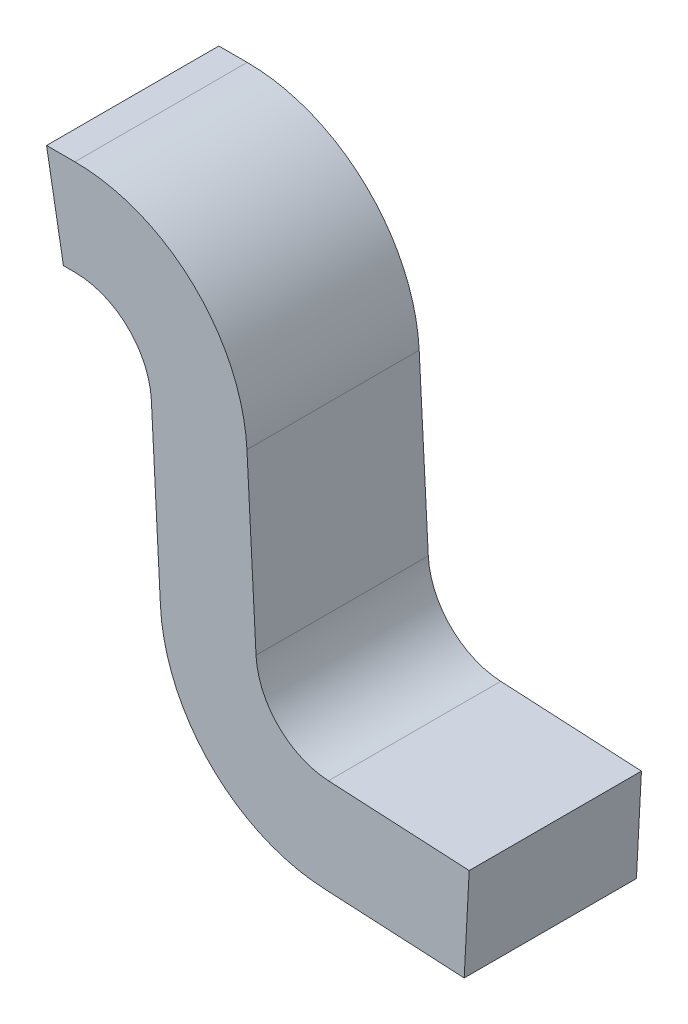
ISO-10303-21;
HEADER;
FILE_DESCRIPTION(('STEP AP214'),'2;1');
FILE_NAME('part.step','',(''),(''),'','','');
FILE_SCHEMA(('AUTOMOTIVE_DESIGN { 1 0 10303 214 1 1 1 1 }'));
ENDSEC;
DATA;
#1=APPLICATION_CONTEXT('core data for automotive mechanical design processes');
#2=APPLICATION_PROTOCOL_DEFINITION('international standard','automotive_design',2000,#1);
#3=PRODUCT_CONTEXT('',#1,'mechanical');
#4=PRODUCT('Part','Part','',(#3));
#5=PRODUCT_RELATED_PRODUCT_CATEGORY('part','',(#4));
#6=PRODUCT_DEFINITION_FORMATION('','',#4);
#7=PRODUCT_DEFINITION_CONTEXT('part definition',#1,'design');
#8=PRODUCT_DEFINITION('design','',#6,#7);
#9=PRODUCT_DEFINITION_SHAPE('','',#8);
#10=(LENGTH_UNIT() NAMED_UNIT(*) SI_UNIT(.MILLI.,.METRE.));
#11=(NAMED_UNIT(*) PLANE_ANGLE_UNIT() SI_UNIT($,.RADIAN.));
#12=(NAMED_UNIT(*) SI_UNIT($,.STERADIAN.) SOLID_ANGLE_UNIT());
#13=UNCERTAINTY_MEASURE_WITH_UNIT(LENGTH_MEASURE(1.E-05),#10,'distance_accuracy_value','');
#14=(GEOMETRIC_REPRESENTATION_CONTEXT(3) GLOBAL_UNCERTAINTY_ASSIGNED_CONTEXT((#13)) GLOBAL_UNIT_ASSIGNED_CONTEXT((#10,
#11,#12)) REPRESENTATION_CONTEXT('',''));
#15=CARTESIAN_POINT('',(0.,0.,0.));
#16=DIRECTION('',(0.,0.,1.));
#17=DIRECTION('',(1.,0.,0.));
#18=AXIS2_PLACEMENT_3D('',#15,#16,#17);
#19=CARTESIAN_POINT('',(0.,0.,-0.1125));
#20=DIRECTION('',(0.,0.,1.));
#21=DIRECTION('',(1.,0.,0.));
#22=AXIS2_PLACEMENT_3D('',#19,#20,#21);
#23=PLANE('',#22);
#24=DIRECTION('',(-0.0523359562429177,0.998629534754575,0.));
#25=VECTOR('',#24,1.);
#26=CARTESIAN_POINT('',(0.861573213012,-0.31493822705,-0.1125));
#27=LINE('',#26,#25);
#28=CARTESIAN_POINT('',(0.861573213012008,-0.31493822705016,-0.1125));
#29=VERTEX_POINT('',#28);
#30=CARTESIAN_POINT('',(0.849691645319655,-0.0882244098453541,-0.1125));
#31=VERTEX_POINT('',#30);
#32=EDGE_CURVE('E144',#29,#31,#27,.T.);
#33=ORIENTED_EDGE('',*,*,#32,.F.);
#34=CARTESIAN_POINT('',(0.961436166488,-0.309704631426,-0.1125));
#35=DIRECTION('',(0.,0.,1.));
#36=DIRECTION('',(1.,0.,0.));
#37=AXIS2_PLACEMENT_3D('',#34,#35,#36);
#38=CIRCLE('',#37,0.1);
#39=CARTESIAN_POINT('',(0.956202570863354,-0.40956758490123,-0.1125));
#40=VERTEX_POINT('',#39);
#41=EDGE_CURVE('E151',#29,#40,#38,.T.);
#42=ORIENTED_EDGE('',*,*,#41,.T.);
#43=DIRECTION('',(-0.998629534754575,0.0523359562429177,0.));
#44=VECTOR('',#43,1.);
#45=CARTESIAN_POINT('',(1.14,-0.4192,-0.1125));
#46=LINE('',#45,#44);
#47=CARTESIAN_POINT('',(1.14000000000012,-0.419200000000006,-0.1125));
#48=VERTEX_POINT('',#47);
#49=EDGE_CURVE('E148',#48,#40,#46,.T.);
#50=ORIENTED_EDGE('',*,*,#49,.F.);
#51=DIRECTION('',(0.0523359562429177,0.998629534754575,0.));
#52=VECTOR('',#51,1.);
#53=CARTESIAN_POINT('',(1.13345800547,-0.544028691844,-0.1125));
#54=LINE('',#53,#52);
#55=CARTESIAN_POINT('',(1.13345800547,-0.544028691843999,-0.1125));
#56=VERTEX_POINT('',#55);
#57=EDGE_CURVE('E155',#56,#48,#54,.T.);
#58=ORIENTED_EDGE('',*,*,#57,.F.);
#59=DIRECTION('',(0.998629534754575,-0.0523359562429177,0.));
#60=VECTOR('',#59,1.);
#61=CARTESIAN_POINT('',(0.949660576333,-0.534396276745,-0.1125));
#62=LINE('',#61,#60);
#63=CARTESIAN_POINT('',(0.949660576333192,-0.53439627674501,-0.1125));
#64=VERTEX_POINT('',#63);
#65=EDGE_CURVE('E160',#64,#56,#62,.T.);
#66=ORIENTED_EDGE('',*,*,#65,.F.);
#67=CARTESIAN_POINT('',(0.961436166488,-0.309704631426,-0.1125));
#68=DIRECTION('',(0.,0.,1.));
#69=DIRECTION('',(1.,0.,0.));
#70=AXIS2_PLACEMENT_3D('',#67,#68,#69);
#71=CIRCLE('',#70,0.225);
#72=CARTESIAN_POINT('',(0.736744521168336,-0.321480221580316,-0.1125));
#73=VERTEX_POINT('',#72);
#74=EDGE_CURVE('E117',#73,#64,#71,.T.);
#75=ORIENTED_EDGE('',*,*,#74,.F.);
#76=DIRECTION('',(0.0523359562429177,-0.998629534754575,0.));
#77=VECTOR('',#76,1.);
#78=CARTESIAN_POINT('',(0.724862953476,-0.09476640437571,-0.1125));
#79=LINE('',#78,#77);
#80=CARTESIAN_POINT('',(0.724862953475999,-0.0947664043756949,-0.1125));
#81=VERTEX_POINT('',#80);
#82=EDGE_CURVE('E114',#81,#73,#79,.T.);
#83=ORIENTED_EDGE('',*,*,#82,.F.);
#84=CARTESIAN_POINT('',(0.625,-0.1,-0.1125));
#85=DIRECTION('',(0.,0.,1.));
#86=DIRECTION('',(1.,0.,0.));
#87=AXIS2_PLACEMENT_3D('',#84,#85,#86);
#88=CIRCLE('',#87,0.1);
#89=CARTESIAN_POINT('',(0.625,0.,-0.1125));
#90=VERTEX_POINT('',#89);
#91=EDGE_CURVE('E20',#81,#90,#88,.T.);
#92=ORIENTED_EDGE('',*,*,#91,.T.);
#93=DIRECTION('',(1.,0.,0.));
#94=VECTOR('',#93,1.);
#95=CARTESIAN_POINT('',(0.61,0.,-0.1125));
#96=LINE('',#95,#94);
#97=CARTESIAN_POINT('',(0.609999999999862,0.,-0.1125));
#98=VERTEX_POINT('',#97);
#99=EDGE_CURVE('E132',#98,#90,#96,.T.);
#100=ORIENTED_EDGE('',*,*,#99,.F.);
#101=DIRECTION('',(0.173648177667033,-0.98480775301219,0.));
#102=VECTOR('',#101,1.);
#103=CARTESIAN_POINT('',(0.587959127411,0.125,-0.1125));
#104=LINE('',#103,#102);
#105=CARTESIAN_POINT('',(0.587959127411,0.125,-0.1125));
#106=VERTEX_POINT('',#105);
#107=EDGE_CURVE('E130',#106,#98,#104,.T.);
#108=ORIENTED_EDGE('',*,*,#107,.F.);
#109=DIRECTION('',(1.,0.,0.));
#110=VECTOR('',#109,1.);
#111=CARTESIAN_POINT('',(0.625,0.125,-0.1125));
#112=LINE('',#111,#110);
#113=CARTESIAN_POINT('',(0.625,0.125,-0.1125));
#114=VERTEX_POINT('',#113);
#115=EDGE_CURVE('E139',#114,#106,#112,.F.);
#116=ORIENTED_EDGE('',*,*,#115,.F.);
#117=CARTESIAN_POINT('',(0.625,-0.1,-0.1125));
#118=DIRECTION('',(0.,0.,1.));
#119=DIRECTION('',(1.,0.,0.));
#120=AXIS2_PLACEMENT_3D('',#117,#118,#119);
#121=CIRCLE('',#120,0.225);
#122=EDGE_CURVE('E180',#31,#114,#121,.T.);
#123=ORIENTED_EDGE('',*,*,#122,.F.);
#124=EDGE_LOOP('',(#33,#42,#50,#58,#66,#75,#83,#92,#100,#108,#116,#123));
#125=FACE_BOUND('',#124,.T.);
#126=ADVANCED_FACE('F17',(#125),#23,.F.);
#127=CARTESIAN_POINT('',(0.625,-0.1,-0.1125));
#128=DIRECTION('',(0.,0.,1.));
#129=DIRECTION('',(1.,0.,0.));
#130=AXIS2_PLACEMENT_3D('',#127,#128,#129);
#131=CYLINDRICAL_SURFACE('',#130,0.1);
#132=CARTESIAN_POINT('',(0.625,-0.1,0.1125));
#133=DIRECTION('',(0.,0.,1.));
#134=DIRECTION('',(1.,0.,0.));
#135=AXIS2_PLACEMENT_3D('',#132,#133,#134);
#136=CIRCLE('',#135,0.1);
#137=CARTESIAN_POINT('',(0.625,0.,0.1125));
#138=VERTEX_POINT('',#137);
#139=CARTESIAN_POINT('',(0.724862953476004,-0.0947664043757943,0.1125));
#140=VERTEX_POINT('',#139);
#141=EDGE_CURVE('E178',#138,#140,#136,.F.);
#142=ORIENTED_EDGE('',*,*,#141,.F.);
#143=DIRECTION('',(0.,0.,-1.));
#144=VECTOR('',#143,1.);
#145=CARTESIAN_POINT('',(0.625,0.,-0.1125));
#146=LINE('',#145,#144);
#147=EDGE_CURVE('E110',#90,#138,#146,.F.);
#148=ORIENTED_EDGE('',*,*,#147,.F.);
#149=ORIENTED_EDGE('',*,*,#91,.F.);
#150=DIRECTION('',(0.,0.,1.));
#151=VECTOR('',#150,1.);
#152=CARTESIAN_POINT('',(0.724862953476,-0.09476640437571,-0.1125));
#153=LINE('',#152,#151);
#154=EDGE_CURVE('E107',#140,#81,#153,.F.);
#155=ORIENTED_EDGE('',*,*,#154,.F.);
#156=EDGE_LOOP('',(#142,#148,#149,#155));
#157=FACE_BOUND('',#156,.T.);
#158=ADVANCED_FACE('F105',(#157),#131,.F.);
#159=CARTESIAN_POINT('',(0.724862953476,-0.09476640437571,-0.1125));
#160=DIRECTION('',(-0.998629534754575,-0.0523359562429177,0.));
#161=DIRECTION('',(0.0523359562429177,-0.998629534754575,0.));
#162=AXIS2_PLACEMENT_3D('',#159,#160,#161);
#163=PLANE('',#162);
#164=ORIENTED_EDGE('',*,*,#154,.T.);
#165=ORIENTED_EDGE('',*,*,#82,.T.);
#166=DIRECTION('',(0.,0.,1.));
#167=VECTOR('',#166,1.);
#168=CARTESIAN_POINT('',(0.736744521168186,-0.32148022157999,-0.1125));
#169=LINE('',#168,#167);
#170=CARTESIAN_POINT('',(0.736744521168099,-0.321480221580105,0.1125));
#171=VERTEX_POINT('',#170);
#172=EDGE_CURVE('E120',#171,#73,#169,.F.);
#173=ORIENTED_EDGE('',*,*,#172,.F.);
#174=DIRECTION('',(0.0523359562409312,-0.998629534754679,0.));
#175=VECTOR('',#174,1.);
#176=CARTESIAN_POINT('',(0.724862953476,-0.09476640437571,0.1125));
#177=LINE('',#176,#175);
#178=EDGE_CURVE('E124',#140,#171,#177,.T.);
#179=ORIENTED_EDGE('',*,*,#178,.F.);
#180=EDGE_LOOP('',(#164,#165,#173,#179));
#181=FACE_BOUND('',#180,.T.);
#182=ADVANCED_FACE('F122',(#181),#163,.T.);
#183=CARTESIAN_POINT('',(0.961436166488,-0.309704631426,-0.1125));
#184=DIRECTION('',(0.,0.,1.));
#185=DIRECTION('',(1.,0.,0.));
#186=AXIS2_PLACEMENT_3D('',#183,#184,#185);
#187=CYLINDRICAL_SURFACE('',#186,0.225);
#188=ORIENTED_EDGE('',*,*,#172,.T.);
#189=ORIENTED_EDGE('',*,*,#74,.T.);
#190=DIRECTION('',(0.,0.,1.));
#191=VECTOR('',#190,1.);
#192=CARTESIAN_POINT('',(0.949660576333,-0.534396276745,-0.1125));
#193=LINE('',#192,#191);
#194=CARTESIAN_POINT('',(0.94966057633319,-0.53439627674501,0.1125));
#195=VERTEX_POINT('',#194);
#196=EDGE_CURVE('E162',#195,#64,#193,.F.);
#197=ORIENTED_EDGE('',*,*,#196,.F.);
#198=CARTESIAN_POINT('',(0.961436166488,-0.309704631426,0.1125));
#199=DIRECTION('',(0.,0.,1.));
#200=DIRECTION('',(1.,0.,0.));
#201=AXIS2_PLACEMENT_3D('',#198,#199,#200);
#202=CIRCLE('',#201,0.225);
#203=EDGE_CURVE('E174',#171,#195,#202,.T.);
#204=ORIENTED_EDGE('',*,*,#203,.F.);
#205=EDGE_LOOP('',(#188,#189,#197,#204));
#206=FACE_BOUND('',#205,.T.);
#207=ADVANCED_FACE('F186',(#206),#187,.T.);
#208=CARTESIAN_POINT('',(0.949660576333,-0.534396276745,-0.1125));
#209=DIRECTION('',(-0.0523359562429177,-0.998629534754575,0.));
#210=DIRECTION('',(0.998629534754575,-0.0523359562429177,0.));
#211=AXIS2_PLACEMENT_3D('',#208,#209,#210);
#212=PLANE('',#211);
#213=ORIENTED_EDGE('',*,*,#196,.T.);
#214=ORIENTED_EDGE('',*,*,#65,.T.);
#215=DIRECTION('',(0.,0.,1.));
#216=VECTOR('',#215,1.);
#217=CARTESIAN_POINT('',(1.13345800547,-0.544028691844,-0.1125));
#218=LINE('',#217,#216);
#219=CARTESIAN_POINT('',(1.13345800547,-0.544028691844,0.1125));
#220=VERTEX_POINT('',#219);
#221=EDGE_CURVE('E157',#220,#56,#218,.F.);
#222=ORIENTED_EDGE('',*,*,#221,.F.);
#223=DIRECTION('',(0.998629534754574,-0.0523359562429318,0.));
#224=VECTOR('',#223,1.);
#225=CARTESIAN_POINT('',(0.949660576333,-0.534396276745,0.1125));
#226=LINE('',#225,#224);
#227=EDGE_CURVE('E177',#195,#220,#226,.T.);
#228=ORIENTED_EDGE('',*,*,#227,.F.);
#229=EDGE_LOOP('',(#213,#214,#222,#228));
#230=FACE_BOUND('',#229,.T.);
#231=ADVANCED_FACE('F233',(#230),#212,.T.);
#232=CARTESIAN_POINT('',(1.13345800547,-0.544028691844,-0.1125));
#233=DIRECTION('',(0.998629534754575,-0.0523359562429177,0.));
#234=DIRECTION('',(0.0523359562429177,0.998629534754575,0.));
#235=AXIS2_PLACEMENT_3D('',#232,#233,#234);
#236=PLANE('',#235);
#237=ORIENTED_EDGE('',*,*,#221,.T.);
#238=ORIENTED_EDGE('',*,*,#57,.T.);
#239=DIRECTION('',(0.,0.,1.));
#240=VECTOR('',#239,1.);
#241=CARTESIAN_POINT('',(1.14,-0.4192,-0.1125));
#242=LINE('',#241,#240);
#243=CARTESIAN_POINT('',(1.14,-0.4192,0.1125));
#244=VERTEX_POINT('',#243);
#245=EDGE_CURVE('E152',#244,#48,#242,.F.);
#246=ORIENTED_EDGE('',*,*,#245,.F.);
#247=DIRECTION('',(0.0523359562401418,0.998629534754721,0.));
#248=VECTOR('',#247,1.);
#249=CARTESIAN_POINT('',(1.13345800547,-0.544028691844,0.1125));
#250=LINE('',#249,#248);
#251=EDGE_CURVE('E219',#220,#244,#250,.T.);
#252=ORIENTED_EDGE('',*,*,#251,.F.);
#253=EDGE_LOOP('',(#237,#238,#246,#252));
#254=FACE_BOUND('',#253,.T.);
#255=ADVANCED_FACE('F229',(#254),#236,.T.);
#256=CARTESIAN_POINT('',(1.14,-0.4192,-0.1125));
#257=DIRECTION('',(0.0523359562429177,0.998629534754575,0.));
#258=DIRECTION('',(-0.998629534754575,0.0523359562429177,0.));
#259=AXIS2_PLACEMENT_3D('',#256,#257,#258);
#260=PLANE('',#259);
#261=ORIENTED_EDGE('',*,*,#245,.T.);
#262=ORIENTED_EDGE('',*,*,#49,.T.);
#263=DIRECTION('',(0.,0.,1.));
#264=VECTOR('',#263,1.);
#265=CARTESIAN_POINT('',(0.956202570862978,-0.409567584901419,-0.1125));
#266=LINE('',#265,#264);
#267=CARTESIAN_POINT('',(0.956202570863353,-0.409567584901229,0.1125));
#268=VERTEX_POINT('',#267);
#269=EDGE_CURVE('E182',#40,#268,#266,.T.);
#270=ORIENTED_EDGE('',*,*,#269,.T.);
#271=DIRECTION('',(-0.998629534754574,0.0523359562429318,0.));
#272=VECTOR('',#271,1.);
#273=CARTESIAN_POINT('',(1.14,-0.4192,0.1125));
#274=LINE('',#273,#272);
#275=EDGE_CURVE('E173',#244,#268,#274,.T.);
#276=ORIENTED_EDGE('',*,*,#275,.F.);
#277=EDGE_LOOP('',(#261,#262,#270,#276));
#278=FACE_BOUND('',#277,.T.);
#279=ADVANCED_FACE('F237',(#278),#260,.T.);
#280=CARTESIAN_POINT('',(0.961436166488,-0.309704631426,-0.1125));
#281=DIRECTION('',(0.,0.,1.));
#282=DIRECTION('',(1.,0.,0.));
#283=AXIS2_PLACEMENT_3D('',#280,#281,#282);
#284=CYLINDRICAL_SURFACE('',#283,0.1);
#285=CARTESIAN_POINT('',(0.961436166488,-0.309704631426,0.1125));
#286=DIRECTION('',(0.,0.,1.));
#287=DIRECTION('',(1.,0.,0.));
#288=AXIS2_PLACEMENT_3D('',#285,#286,#287);
#289=CIRCLE('',#288,0.1);
#290=CARTESIAN_POINT('',(0.861573213012003,-0.314938227050056,0.1125));
#291=VERTEX_POINT('',#290);
#292=EDGE_CURVE('E170',#268,#291,#289,.F.);
#293=ORIENTED_EDGE('',*,*,#292,.F.);
#294=ORIENTED_EDGE('',*,*,#269,.F.);
#295=ORIENTED_EDGE('',*,*,#41,.F.);
#296=DIRECTION('',(0.,0.,1.));
#297=VECTOR('',#296,1.);
#298=CARTESIAN_POINT('',(0.861573213012,-0.31493822705,-0.1125));
#299=LINE('',#298,#297);
#300=EDGE_CURVE('E147',#291,#29,#299,.F.);
#301=ORIENTED_EDGE('',*,*,#300,.F.);
#302=EDGE_LOOP('',(#293,#294,#295,#301));
#303=FACE_BOUND('',#302,.T.);
#304=ADVANCED_FACE('F312',(#303),#284,.F.);
#305=CARTESIAN_POINT('',(0.861573213012,-0.31493822705,-0.1125));
#306=DIRECTION('',(0.998629534754575,0.0523359562429177,0.));
#307=DIRECTION('',(-0.0523359562429177,0.998629534754575,0.));
#308=AXIS2_PLACEMENT_3D('',#305,#306,#307);
#309=PLANE('',#308);
#310=ORIENTED_EDGE('',*,*,#300,.T.);
#311=ORIENTED_EDGE('',*,*,#32,.T.);
#312=DIRECTION('',(0.,0.,1.));
#313=VECTOR('',#312,1.);
#314=CARTESIAN_POINT('',(0.84969164531978,-0.0882244098453515,-0.1125));
#315=LINE('',#314,#313);
#316=CARTESIAN_POINT('',(0.849691645319902,-0.0882244098455748,0.1125));
#317=VERTEX_POINT('',#316);
#318=EDGE_CURVE('E146',#317,#31,#315,.F.);
#319=ORIENTED_EDGE('',*,*,#318,.F.);
#320=DIRECTION('',(-0.052335956240846,0.998629534754684,0.));
#321=VECTOR('',#320,1.);
#322=CARTESIAN_POINT('',(0.861573213012,-0.31493822705,0.1125));
#323=LINE('',#322,#321);
#324=EDGE_CURVE('E169',#291,#317,#323,.T.);
#325=ORIENTED_EDGE('',*,*,#324,.F.);
#326=EDGE_LOOP('',(#310,#311,#319,#325));
#327=FACE_BOUND('',#326,.T.);
#328=ADVANCED_FACE('F302',(#327),#309,.T.);
#329=CARTESIAN_POINT('',(0.625,-0.1,-0.1125));
#330=DIRECTION('',(0.,0.,1.));
#331=DIRECTION('',(1.,0.,0.));
#332=AXIS2_PLACEMENT_3D('',#329,#330,#331);
#333=CYLINDRICAL_SURFACE('',#332,0.225);
#334=ORIENTED_EDGE('',*,*,#318,.T.);
#335=ORIENTED_EDGE('',*,*,#122,.T.);
#336=DIRECTION('',(0.,0.,1.));
#337=VECTOR('',#336,1.);
#338=CARTESIAN_POINT('',(0.625,0.125,-0.1125));
#339=LINE('',#338,#337);
#340=CARTESIAN_POINT('',(0.625,0.125,0.1125));
#341=VERTEX_POINT('',#340);
#342=EDGE_CURVE('E141',#341,#114,#339,.F.);
#343=ORIENTED_EDGE('',*,*,#342,.F.);
#344=CARTESIAN_POINT('',(0.625,-0.1,0.1125));
#345=DIRECTION('',(0.,0.,1.));
#346=DIRECTION('',(1.,0.,0.));
#347=AXIS2_PLACEMENT_3D('',#344,#345,#346);
#348=CIRCLE('',#347,0.225);
#349=EDGE_CURVE('E165',#317,#341,#348,.T.);
#350=ORIENTED_EDGE('',*,*,#349,.F.);
#351=EDGE_LOOP('',(#334,#335,#343,#350));
#352=FACE_BOUND('',#351,.T.);
#353=ADVANCED_FACE('F268',(#352),#333,.T.);
#354=CARTESIAN_POINT('',(0.625,0.125,-0.1125));
#355=DIRECTION('',(0.,1.,0.));
#356=DIRECTION('',(0.,0.,1.));
#357=AXIS2_PLACEMENT_3D('',#354,#355,#356);
#358=PLANE('',#357);
#359=DIRECTION('',(0.,0.,1.));
#360=VECTOR('',#359,1.);
#361=CARTESIAN_POINT('',(0.587959127411,0.125,-0.1125));
#362=LINE('',#361,#360);
#363=CARTESIAN_POINT('',(0.587959127411,0.125,0.1125));
#364=VERTEX_POINT('',#363);
#365=EDGE_CURVE('E133',#364,#106,#362,.F.);
#366=ORIENTED_EDGE('',*,*,#365,.F.);
#367=DIRECTION('',(1.,0.,0.));
#368=VECTOR('',#367,1.);
#369=CARTESIAN_POINT('',(0.,0.125,0.1125));
#370=LINE('',#369,#368);
#371=EDGE_CURVE('E168',#341,#364,#370,.F.);
#372=ORIENTED_EDGE('',*,*,#371,.F.);
#373=ORIENTED_EDGE('',*,*,#342,.T.);
#374=ORIENTED_EDGE('',*,*,#115,.T.);
#375=EDGE_LOOP('',(#366,#372,#373,#374));
#376=FACE_BOUND('',#375,.T.);
#377=ADVANCED_FACE('F254',(#376),#358,.T.);
#378=CARTESIAN_POINT('',(0.587959127411,0.125,-0.1125));
#379=DIRECTION('',(-0.98480775301219,-0.173648177667033,0.));
#380=DIRECTION('',(0.173648177667033,-0.98480775301219,0.));
#381=AXIS2_PLACEMENT_3D('',#378,#379,#380);
#382=PLANE('',#381);
#383=ORIENTED_EDGE('',*,*,#107,.T.);
#384=DIRECTION('',(0.,0.,-1.));
#385=VECTOR('',#384,1.);
#386=CARTESIAN_POINT('',(0.61,0.,-0.1125));
#387=LINE('',#386,#385);
#388=CARTESIAN_POINT('',(0.61,0.,0.1125));
#389=VERTEX_POINT('',#388);
#390=EDGE_CURVE('E35',#389,#98,#387,.T.);
#391=ORIENTED_EDGE('',*,*,#390,.F.);
#392=DIRECTION('',(0.173648177670306,-0.984807753011613,0.));
#393=VECTOR('',#392,1.);
#394=CARTESIAN_POINT('',(0.587959127411,0.125,0.1125));
#395=LINE('',#394,#393);
#396=EDGE_CURVE('E26',#364,#389,#395,.T.);
#397=ORIENTED_EDGE('',*,*,#396,.F.);
#398=ORIENTED_EDGE('',*,*,#365,.T.);
#399=EDGE_LOOP('',(#383,#391,#397,#398));
#400=FACE_BOUND('',#399,.T.);
#401=ADVANCED_FACE('F257',(#400),#382,.T.);
#402=CARTESIAN_POINT('',(0.61,0.,-0.1125));
#403=DIRECTION('',(0.,-1.,0.));
#404=DIRECTION('',(0.,0.,-1.));
#405=AXIS2_PLACEMENT_3D('',#402,#403,#404);
#406=PLANE('',#405);
#407=DIRECTION('',(1.,0.,0.));
#408=VECTOR('',#407,1.);
#409=CARTESIAN_POINT('',(0.,0.,0.1125));
#410=LINE('',#409,#408);
#411=EDGE_CURVE('E11',#389,#138,#410,.T.);
#412=ORIENTED_EDGE('',*,*,#411,.F.);
#413=ORIENTED_EDGE('',*,*,#390,.T.);
#414=ORIENTED_EDGE('',*,*,#99,.T.);
#415=ORIENTED_EDGE('',*,*,#147,.T.);
#416=EDGE_LOOP('',(#412,#413,#414,#415));
#417=FACE_BOUND('',#416,.T.);
#418=ADVANCED_FACE('F259',(#417),#406,.T.);
#419=CARTESIAN_POINT('',(0.,0.,0.1125));
#420=DIRECTION('',(0.,0.,1.));
#421=DIRECTION('',(1.,0.,0.));
#422=AXIS2_PLACEMENT_3D('',#419,#420,#421);
#423=PLANE('',#422);
#424=ORIENTED_EDGE('',*,*,#396,.T.);
#425=ORIENTED_EDGE('',*,*,#411,.T.);
#426=ORIENTED_EDGE('',*,*,#141,.T.);
#427=ORIENTED_EDGE('',*,*,#178,.T.);
#428=ORIENTED_EDGE('',*,*,#203,.T.);
#429=ORIENTED_EDGE('',*,*,#227,.T.);
#430=ORIENTED_EDGE('',*,*,#251,.T.);
#431=ORIENTED_EDGE('',*,*,#275,.T.);
#432=ORIENTED_EDGE('',*,*,#292,.T.);
#433=ORIENTED_EDGE('',*,*,#324,.T.);
#434=ORIENTED_EDGE('',*,*,#349,.T.);
#435=ORIENTED_EDGE('',*,*,#371,.T.);
#436=EDGE_LOOP('',(#424,#425,#426,#427,#428,#429,#430,#431,#432,#433,#434,#435));
#437=FACE_BOUND('',#436,.T.);
#438=ADVANCED_FACE('F191',(#437),#423,.T.);
#439=CLOSED_SHELL('',(#126,#158,#182,#207,#231,#255,#279,#304,#328,#353,#377,#401,#418,#438));
#440=MANIFOLD_SOLID_BREP('B1',#439);
#441=ADVANCED_BREP_SHAPE_REPRESENTATION('',(#18,#440),#14);
#442=SHAPE_DEFINITION_REPRESENTATION(#9,#441);
ENDSEC;
END-ISO-10303-21;
